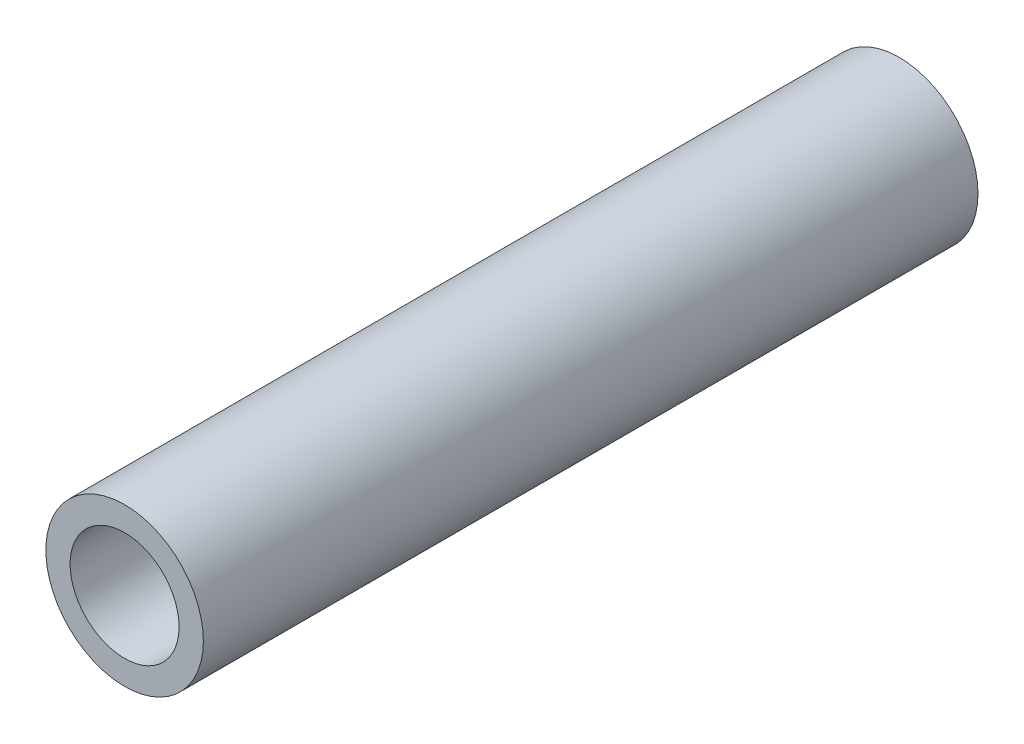
ISO-10303-21;
HEADER;
FILE_DESCRIPTION(('STEP AP214'),'2;1');
FILE_NAME('part.step','',(''),(''),'','','');
FILE_SCHEMA(('AUTOMOTIVE_DESIGN { 1 0 10303 214 1 1 1 1 }'));
ENDSEC;
DATA;
#1=APPLICATION_CONTEXT('core data for automotive mechanical design processes');
#2=APPLICATION_PROTOCOL_DEFINITION('international standard','automotive_design',2000,#1);
#3=PRODUCT_CONTEXT('',#1,'mechanical');
#4=PRODUCT('Part','Part','',(#3));
#5=PRODUCT_RELATED_PRODUCT_CATEGORY('part','',(#4));
#6=PRODUCT_DEFINITION_FORMATION('','',#4);
#7=PRODUCT_DEFINITION_CONTEXT('part definition',#1,'design');
#8=PRODUCT_DEFINITION('design','',#6,#7);
#9=PRODUCT_DEFINITION_SHAPE('','',#8);
#10=(LENGTH_UNIT() NAMED_UNIT(*) SI_UNIT(.MILLI.,.METRE.));
#11=(NAMED_UNIT(*) PLANE_ANGLE_UNIT() SI_UNIT($,.RADIAN.));
#12=(NAMED_UNIT(*) SI_UNIT($,.STERADIAN.) SOLID_ANGLE_UNIT());
#13=UNCERTAINTY_MEASURE_WITH_UNIT(LENGTH_MEASURE(1.E-05),#10,'distance_accuracy_value','');
#14=(GEOMETRIC_REPRESENTATION_CONTEXT(3) GLOBAL_UNCERTAINTY_ASSIGNED_CONTEXT((#13)) GLOBAL_UNIT_ASSIGNED_CONTEXT((#10,
#11,#12)) REPRESENTATION_CONTEXT('',''));
#15=CARTESIAN_POINT('',(0.,0.,0.));
#16=DIRECTION('',(0.,0.,1.));
#17=DIRECTION('',(1.,0.,0.));
#18=AXIS2_PLACEMENT_3D('',#15,#16,#17);
#19=CARTESIAN_POINT('',(0.,0.,76.2));
#20=DIRECTION('',(0.,0.,1.));
#21=DIRECTION('',(1.,0.,0.));
#22=AXIS2_PLACEMENT_3D('',#19,#20,#21);
#23=PLANE('',#22);
#24=CARTESIAN_POINT('',(0.,0.,76.2));
#25=DIRECTION('',(0.,0.,1.));
#26=DIRECTION('',(1.,0.,0.));
#27=AXIS2_PLACEMENT_3D('',#24,#25,#26);
#28=CIRCLE('',#27,7.747);
#29=CARTESIAN_POINT('',(7.747,0.,76.2));
#30=VERTEX_POINT('',#29);
#31=EDGE_CURVE('E10',#30,#30,#28,.T.);
#32=ORIENTED_EDGE('',*,*,#31,.T.);
#33=EDGE_LOOP('',(#32));
#34=FACE_BOUND('',#33,.T.);
#35=CARTESIAN_POINT('',(0.,0.,76.2));
#36=DIRECTION('',(0.,0.,1.));
#37=DIRECTION('',(1.,0.,0.));
#38=AXIS2_PLACEMENT_3D('',#35,#36,#37);
#39=CIRCLE('',#38,5.3594);
#40=CARTESIAN_POINT('',(5.3594,0.,76.2));
#41=VERTEX_POINT('',#40);
#42=EDGE_CURVE('E41',#41,#41,#39,.T.);
#43=ORIENTED_EDGE('',*,*,#42,.F.);
#44=EDGE_LOOP('',(#43));
#45=FACE_BOUND('',#44,.T.);
#46=ADVANCED_FACE('F30',(#34,#45),#23,.T.);
#47=CARTESIAN_POINT('',(0.,0.,0.));
#48=DIRECTION('',(0.,0.,1.));
#49=DIRECTION('',(1.,0.,0.));
#50=AXIS2_PLACEMENT_3D('',#47,#48,#49);
#51=PLANE('',#50);
#52=CARTESIAN_POINT('',(0.,0.,0.));
#53=DIRECTION('',(0.,0.,1.));
#54=DIRECTION('',(1.,0.,0.));
#55=AXIS2_PLACEMENT_3D('',#52,#53,#54);
#56=CIRCLE('',#55,7.747);
#57=CARTESIAN_POINT('',(7.747,0.,0.));
#58=VERTEX_POINT('',#57);
#59=EDGE_CURVE('E34',#58,#58,#56,.T.);
#60=ORIENTED_EDGE('',*,*,#59,.F.);
#61=EDGE_LOOP('',(#60));
#62=FACE_BOUND('',#61,.T.);
#63=CARTESIAN_POINT('',(0.,0.,0.));
#64=DIRECTION('',(0.,0.,1.));
#65=DIRECTION('',(1.,0.,0.));
#66=AXIS2_PLACEMENT_3D('',#63,#64,#65);
#67=CIRCLE('',#66,5.3594);
#68=CARTESIAN_POINT('',(5.3594,0.,0.));
#69=VERTEX_POINT('',#68);
#70=EDGE_CURVE('E43',#69,#69,#67,.T.);
#71=ORIENTED_EDGE('',*,*,#70,.T.);
#72=EDGE_LOOP('',(#71));
#73=FACE_BOUND('',#72,.T.);
#74=ADVANCED_FACE('F53',(#62,#73),#51,.F.);
#75=CARTESIAN_POINT('',(0.,0.,76.2));
#76=DIRECTION('',(0.,0.,-1.));
#77=DIRECTION('',(-1.,0.,0.));
#78=AXIS2_PLACEMENT_3D('',#75,#76,#77);
#79=CYLINDRICAL_SURFACE('',#78,7.747);
#80=ORIENTED_EDGE('',*,*,#31,.F.);
#81=EDGE_LOOP('',(#80));
#82=FACE_BOUND('',#81,.T.);
#83=ORIENTED_EDGE('',*,*,#59,.T.);
#84=EDGE_LOOP('',(#83));
#85=FACE_BOUND('',#84,.T.);
#86=ADVANCED_FACE('F32',(#82,#85),#79,.T.);
#87=CARTESIAN_POINT('',(0.,0.,76.2));
#88=DIRECTION('',(0.,0.,-1.));
#89=DIRECTION('',(-1.,0.,0.));
#90=AXIS2_PLACEMENT_3D('',#87,#88,#89);
#91=CYLINDRICAL_SURFACE('',#90,5.3594);
#92=ORIENTED_EDGE('',*,*,#42,.T.);
#93=EDGE_LOOP('',(#92));
#94=FACE_BOUND('',#93,.T.);
#95=ORIENTED_EDGE('',*,*,#70,.F.);
#96=EDGE_LOOP('',(#95));
#97=FACE_BOUND('',#96,.T.);
#98=ADVANCED_FACE('F49',(#94,#97),#91,.F.);
#99=CLOSED_SHELL('',(#46,#74,#86,#98));
#100=MANIFOLD_SOLID_BREP('B2',#99);
#101=ADVANCED_BREP_SHAPE_REPRESENTATION('',(#18,#100),#14);
#102=SHAPE_DEFINITION_REPRESENTATION(#9,#101);
ENDSEC;
END-ISO-10303-21;
